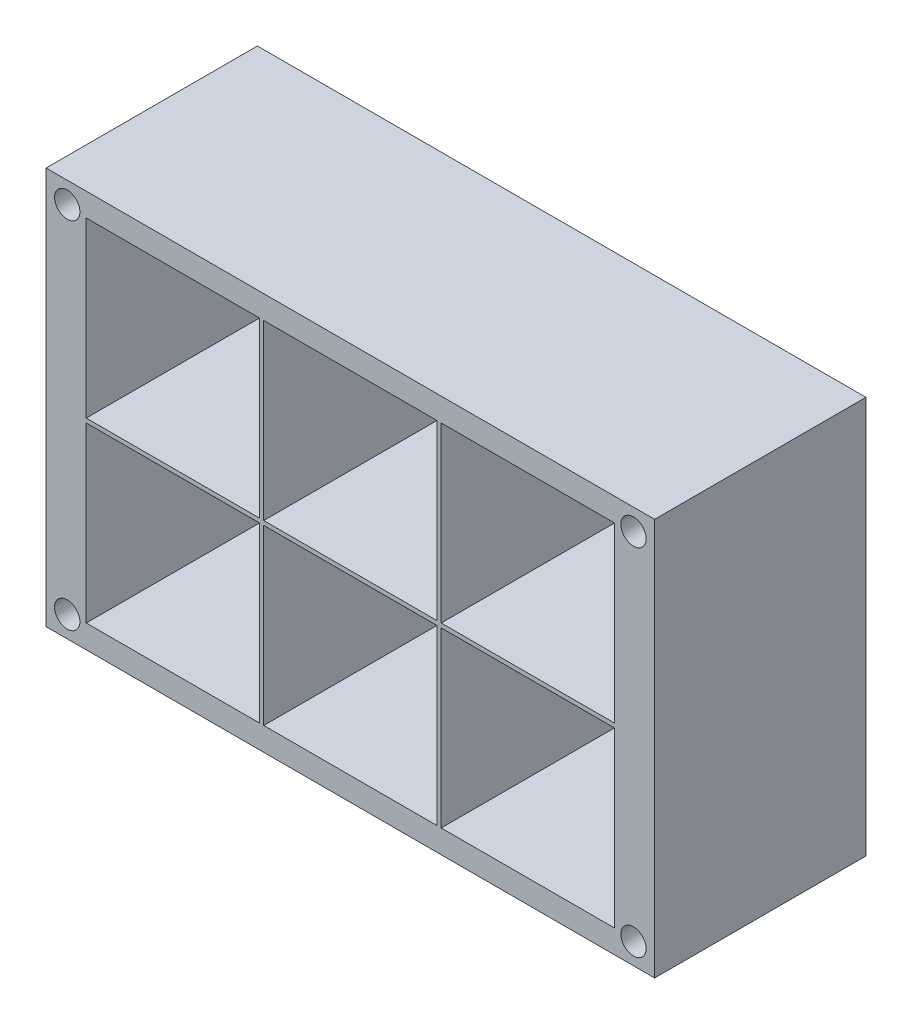
ISO-10303-21;
HEADER;
FILE_DESCRIPTION(('STEP AP214'),'2;1');
FILE_NAME('part.step','',(''),(''),'','','');
FILE_SCHEMA(('AUTOMOTIVE_DESIGN { 1 0 10303 214 1 1 1 1 }'));
ENDSEC;
DATA;
#1=APPLICATION_CONTEXT('core data for automotive mechanical design processes');
#2=APPLICATION_PROTOCOL_DEFINITION('international standard','automotive_design',2000,#1);
#3=PRODUCT_CONTEXT('',#1,'mechanical');
#4=PRODUCT('Part','Part','',(#3));
#5=PRODUCT_RELATED_PRODUCT_CATEGORY('part','',(#4));
#6=PRODUCT_DEFINITION_FORMATION('','',#4);
#7=PRODUCT_DEFINITION_CONTEXT('part definition',#1,'design');
#8=PRODUCT_DEFINITION('design','',#6,#7);
#9=PRODUCT_DEFINITION_SHAPE('','',#8);
#10=(LENGTH_UNIT() NAMED_UNIT(*) SI_UNIT(.MILLI.,.METRE.));
#11=(NAMED_UNIT(*) PLANE_ANGLE_UNIT() SI_UNIT($,.RADIAN.));
#12=(NAMED_UNIT(*) SI_UNIT($,.STERADIAN.) SOLID_ANGLE_UNIT());
#13=UNCERTAINTY_MEASURE_WITH_UNIT(LENGTH_MEASURE(1.E-05),#10,'distance_accuracy_value','');
#14=(GEOMETRIC_REPRESENTATION_CONTEXT(3) GLOBAL_UNCERTAINTY_ASSIGNED_CONTEXT((#13)) GLOBAL_UNIT_ASSIGNED_CONTEXT((#10,
#11,#12)) REPRESENTATION_CONTEXT('',''));
#15=CARTESIAN_POINT('',(0.,0.,0.));
#16=DIRECTION('',(0.,0.,1.));
#17=DIRECTION('',(1.,0.,0.));
#18=AXIS2_PLACEMENT_3D('',#15,#16,#17);
#19=CARTESIAN_POINT('',(0.,0.,25.));
#20=DIRECTION('',(0.,0.,1.));
#21=DIRECTION('',(1.,0.,0.));
#22=AXIS2_PLACEMENT_3D('',#19,#20,#21);
#23=PLANE('',#22);
#24=CARTESIAN_POINT('',(-82.8848384424191,62.1739891406479,25.));
#25=DIRECTION('',(0.,0.,1.));
#26=DIRECTION('',(1.,0.,0.));
#27=AXIS2_PLACEMENT_3D('',#24,#25,#26);
#28=CIRCLE('',#27,1.50000000000001);
#29=CARTESIAN_POINT('',(-81.3848384424191,62.1739891406479,25.));
#30=VERTEX_POINT('',#29);
#31=EDGE_CURVE('E761',#30,#30,#28,.T.);
#32=ORIENTED_EDGE('',*,*,#31,.F.);
#33=EDGE_LOOP('',(#32));
#34=FACE_BOUND('',#33,.T.);
#35=CARTESIAN_POINT('',(-15.8848384424187,20.1739891406484,25.));
#36=DIRECTION('',(0.,0.,1.));
#37=DIRECTION('',(1.,0.,0.));
#38=AXIS2_PLACEMENT_3D('',#35,#36,#37);
#39=CIRCLE('',#38,1.5);
#40=CARTESIAN_POINT('',(-14.3848384424187,20.1739891406484,25.));
#41=VERTEX_POINT('',#40);
#42=EDGE_CURVE('E767',#41,#41,#39,.T.);
#43=ORIENTED_EDGE('',*,*,#42,.F.);
#44=EDGE_LOOP('',(#43));
#45=FACE_BOUND('',#44,.T.);
#46=CARTESIAN_POINT('',(-82.8848384424187,20.1739891406479,25.));
#47=DIRECTION('',(0.,0.,1.));
#48=DIRECTION('',(1.,0.,0.));
#49=AXIS2_PLACEMENT_3D('',#46,#47,#48);
#50=CIRCLE('',#49,1.50000000000001);
#51=CARTESIAN_POINT('',(-81.3848384424187,20.1739891406479,25.));
#52=VERTEX_POINT('',#51);
#53=EDGE_CURVE('E784',#52,#52,#50,.T.);
#54=ORIENTED_EDGE('',*,*,#53,.F.);
#55=EDGE_LOOP('',(#54));
#56=FACE_BOUND('',#55,.T.);
#57=CARTESIAN_POINT('',(-15.8848384424191,62.1739891406484,25.));
#58=DIRECTION('',(0.,0.,1.));
#59=DIRECTION('',(1.,0.,0.));
#60=AXIS2_PLACEMENT_3D('',#57,#58,#59);
#61=CIRCLE('',#60,1.5);
#62=CARTESIAN_POINT('',(-14.3848384424191,62.1739891406484,25.));
#63=VERTEX_POINT('',#62);
#64=EDGE_CURVE('E764',#63,#63,#61,.T.);
#65=ORIENTED_EDGE('',*,*,#64,.F.);
#66=EDGE_LOOP('',(#65));
#67=FACE_BOUND('',#66,.T.);
#68=DIRECTION('',(0.,-1.,0.));
#69=VECTOR('',#68,1.);
#70=CARTESIAN_POINT('',(-85.3848384424192,64.6739891406484,25.));
#71=LINE('',#70,#69);
#72=CARTESIAN_POINT('',(-85.3848384424192,64.6739891406484,25.));
#73=VERTEX_POINT('',#72);
#74=CARTESIAN_POINT('',(-85.3848384424192,17.6739891406484,25.));
#75=VERTEX_POINT('',#74);
#76=EDGE_CURVE('E411',#73,#75,#71,.T.);
#77=ORIENTED_EDGE('',*,*,#76,.T.);
#78=DIRECTION('',(1.,0.,0.));
#79=VECTOR('',#78,1.);
#80=CARTESIAN_POINT('',(-85.3848384424192,17.6739891406484,25.));
#81=LINE('',#80,#79);
#82=CARTESIAN_POINT('',(-13.3848384424191,17.6739891406484,25.));
#83=VERTEX_POINT('',#82);
#84=EDGE_CURVE('E414',#75,#83,#81,.T.);
#85=ORIENTED_EDGE('',*,*,#84,.T.);
#86=DIRECTION('',(0.,1.,0.));
#87=VECTOR('',#86,1.);
#88=CARTESIAN_POINT('',(-13.3848384424191,64.6739891406484,25.));
#89=LINE('',#88,#87);
#90=CARTESIAN_POINT('',(-13.3848384424191,64.6739891406484,25.));
#91=VERTEX_POINT('',#90);
#92=EDGE_CURVE('E417',#83,#91,#89,.T.);
#93=ORIENTED_EDGE('',*,*,#92,.T.);
#94=DIRECTION('',(-1.,0.,0.));
#95=VECTOR('',#94,1.);
#96=CARTESIAN_POINT('',(-85.3848384424192,64.6739891406484,25.));
#97=LINE('',#96,#95);
#98=EDGE_CURVE('E419',#91,#73,#97,.T.);
#99=ORIENTED_EDGE('',*,*,#98,.T.);
#100=EDGE_LOOP('',(#77,#85,#93,#99));
#101=FACE_BOUND('',#100,.T.);
#102=DIRECTION('',(1.,0.,0.));
#103=VECTOR('',#102,1.);
#104=CARTESIAN_POINT('',(-80.6348384424191,20.4239891406484,25.));
#105=LINE('',#104,#103);
#106=CARTESIAN_POINT('',(-80.6348384424191,20.4239891406484,25.));
#107=VERTEX_POINT('',#106);
#108=CARTESIAN_POINT('',(-60.1348384424191,20.4239891406484,25.));
#109=VERTEX_POINT('',#108);
#110=EDGE_CURVE('E382',#107,#109,#105,.T.);
#111=ORIENTED_EDGE('',*,*,#110,.F.);
#112=DIRECTION('',(0.,-1.,0.));
#113=VECTOR('',#112,1.);
#114=CARTESIAN_POINT('',(-80.6348384424191,40.9239891406484,25.));
#115=LINE('',#114,#113);
#116=CARTESIAN_POINT('',(-80.6348384424191,40.9239891406484,25.));
#117=VERTEX_POINT('',#116);
#118=EDGE_CURVE('E380',#117,#107,#115,.T.);
#119=ORIENTED_EDGE('',*,*,#118,.F.);
#120=DIRECTION('',(-1.,0.,0.));
#121=VECTOR('',#120,1.);
#122=CARTESIAN_POINT('',(-80.6348384424191,40.9239891406484,25.));
#123=LINE('',#122,#121);
#124=CARTESIAN_POINT('',(-60.1348384424191,40.9239891406484,25.));
#125=VERTEX_POINT('',#124);
#126=EDGE_CURVE('E388',#125,#117,#123,.T.);
#127=ORIENTED_EDGE('',*,*,#126,.F.);
#128=DIRECTION('',(0.,1.,0.));
#129=VECTOR('',#128,1.);
#130=CARTESIAN_POINT('',(-60.1348384424191,40.9239891406484,25.));
#131=LINE('',#130,#129);
#132=EDGE_CURVE('E385',#109,#125,#131,.T.);
#133=ORIENTED_EDGE('',*,*,#132,.F.);
#134=EDGE_LOOP('',(#111,#119,#127,#133));
#135=FACE_BOUND('',#134,.T.);
#136=DIRECTION('',(0.,-1.,0.));
#137=VECTOR('',#136,1.);
#138=CARTESIAN_POINT('',(-80.6348384424192,61.9239891406484,25.));
#139=LINE('',#138,#137);
#140=CARTESIAN_POINT('',(-80.6348384424192,61.9239891406484,25.));
#141=VERTEX_POINT('',#140);
#142=CARTESIAN_POINT('',(-80.6348384424192,41.4239891406484,25.));
#143=VERTEX_POINT('',#142);
#144=EDGE_CURVE('E351',#141,#143,#139,.T.);
#145=ORIENTED_EDGE('',*,*,#144,.F.);
#146=DIRECTION('',(-1.,0.,0.));
#147=VECTOR('',#146,1.);
#148=CARTESIAN_POINT('',(-80.6348384424192,61.9239891406484,25.));
#149=LINE('',#148,#147);
#150=CARTESIAN_POINT('',(-60.1348384424192,61.9239891406484,25.));
#151=VERTEX_POINT('',#150);
#152=EDGE_CURVE('E349',#151,#141,#149,.T.);
#153=ORIENTED_EDGE('',*,*,#152,.F.);
#154=DIRECTION('',(0.,1.,0.));
#155=VECTOR('',#154,1.);
#156=CARTESIAN_POINT('',(-60.1348384424192,61.9239891406484,25.));
#157=LINE('',#156,#155);
#158=CARTESIAN_POINT('',(-60.1348384424192,41.4239891406484,25.));
#159=VERTEX_POINT('',#158);
#160=EDGE_CURVE('E357',#159,#151,#157,.T.);
#161=ORIENTED_EDGE('',*,*,#160,.F.);
#162=DIRECTION('',(1.,0.,0.));
#163=VECTOR('',#162,1.);
#164=CARTESIAN_POINT('',(-80.6348384424192,41.4239891406484,25.));
#165=LINE('',#164,#163);
#166=EDGE_CURVE('E354',#143,#159,#165,.T.);
#167=ORIENTED_EDGE('',*,*,#166,.F.);
#168=EDGE_LOOP('',(#145,#153,#161,#167));
#169=FACE_BOUND('',#168,.T.);
#170=DIRECTION('',(0.,-1.,0.));
#171=VECTOR('',#170,1.);
#172=CARTESIAN_POINT('',(-59.6348384424191,40.9239891406484,25.));
#173=LINE('',#172,#171);
#174=CARTESIAN_POINT('',(-59.6348384424191,40.9239891406484,25.));
#175=VERTEX_POINT('',#174);
#176=CARTESIAN_POINT('',(-59.6348384424191,20.4239891406484,25.));
#177=VERTEX_POINT('',#176);
#178=EDGE_CURVE('E320',#175,#177,#173,.T.);
#179=ORIENTED_EDGE('',*,*,#178,.F.);
#180=DIRECTION('',(-1.,0.,0.));
#181=VECTOR('',#180,1.);
#182=CARTESIAN_POINT('',(-59.6348384424191,40.9239891406484,25.));
#183=LINE('',#182,#181);
#184=CARTESIAN_POINT('',(-39.1348384424191,40.9239891406484,25.));
#185=VERTEX_POINT('',#184);
#186=EDGE_CURVE('E318',#185,#175,#183,.T.);
#187=ORIENTED_EDGE('',*,*,#186,.F.);
#188=DIRECTION('',(0.,1.,0.));
#189=VECTOR('',#188,1.);
#190=CARTESIAN_POINT('',(-39.1348384424191,40.9239891406484,25.));
#191=LINE('',#190,#189);
#192=CARTESIAN_POINT('',(-39.1348384424191,20.4239891406484,25.));
#193=VERTEX_POINT('',#192);
#194=EDGE_CURVE('E326',#193,#185,#191,.T.);
#195=ORIENTED_EDGE('',*,*,#194,.F.);
#196=DIRECTION('',(1.,0.,0.));
#197=VECTOR('',#196,1.);
#198=CARTESIAN_POINT('',(-59.6348384424191,20.4239891406484,25.));
#199=LINE('',#198,#197);
#200=EDGE_CURVE('E323',#177,#193,#199,.T.);
#201=ORIENTED_EDGE('',*,*,#200,.F.);
#202=EDGE_LOOP('',(#179,#187,#195,#201));
#203=FACE_BOUND('',#202,.T.);
#204=DIRECTION('',(0.,-1.,0.));
#205=VECTOR('',#204,1.);
#206=CARTESIAN_POINT('',(-38.6348384424191,40.9239891406484,25.));
#207=LINE('',#206,#205);
#208=CARTESIAN_POINT('',(-38.6348384424191,40.9239891406484,25.));
#209=VERTEX_POINT('',#208);
#210=CARTESIAN_POINT('',(-38.6348384424191,20.4239891406484,25.));
#211=VERTEX_POINT('',#210);
#212=EDGE_CURVE('E289',#209,#211,#207,.T.);
#213=ORIENTED_EDGE('',*,*,#212,.F.);
#214=DIRECTION('',(-1.,0.,0.));
#215=VECTOR('',#214,1.);
#216=CARTESIAN_POINT('',(-38.6348384424191,40.9239891406484,25.));
#217=LINE('',#216,#215);
#218=CARTESIAN_POINT('',(-18.1348384424191,40.9239891406484,25.));
#219=VERTEX_POINT('',#218);
#220=EDGE_CURVE('E287',#219,#209,#217,.T.);
#221=ORIENTED_EDGE('',*,*,#220,.F.);
#222=DIRECTION('',(0.,1.,0.));
#223=VECTOR('',#222,1.);
#224=CARTESIAN_POINT('',(-18.1348384424191,40.9239891406484,25.));
#225=LINE('',#224,#223);
#226=CARTESIAN_POINT('',(-18.1348384424191,20.4239891406484,25.));
#227=VERTEX_POINT('',#226);
#228=EDGE_CURVE('E295',#227,#219,#225,.T.);
#229=ORIENTED_EDGE('',*,*,#228,.F.);
#230=DIRECTION('',(1.,0.,0.));
#231=VECTOR('',#230,1.);
#232=CARTESIAN_POINT('',(-38.6348384424191,20.4239891406484,25.));
#233=LINE('',#232,#231);
#234=EDGE_CURVE('E292',#211,#227,#233,.T.);
#235=ORIENTED_EDGE('',*,*,#234,.F.);
#236=EDGE_LOOP('',(#213,#221,#229,#235));
#237=FACE_BOUND('',#236,.T.);
#238=DIRECTION('',(0.,-1.,0.));
#239=VECTOR('',#238,1.);
#240=CARTESIAN_POINT('',(-59.6348384424192,61.9239891406484,25.));
#241=LINE('',#240,#239);
#242=CARTESIAN_POINT('',(-59.6348384424192,61.9239891406484,25.));
#243=VERTEX_POINT('',#242);
#244=CARTESIAN_POINT('',(-59.6348384424192,41.4239891406484,25.));
#245=VERTEX_POINT('',#244);
#246=EDGE_CURVE('E258',#243,#245,#241,.T.);
#247=ORIENTED_EDGE('',*,*,#246,.F.);
#248=DIRECTION('',(-1.,0.,0.));
#249=VECTOR('',#248,1.);
#250=CARTESIAN_POINT('',(-59.6348384424192,61.9239891406484,25.));
#251=LINE('',#250,#249);
#252=CARTESIAN_POINT('',(-39.1348384424192,61.9239891406484,25.));
#253=VERTEX_POINT('',#252);
#254=EDGE_CURVE('E256',#253,#243,#251,.T.);
#255=ORIENTED_EDGE('',*,*,#254,.F.);
#256=DIRECTION('',(0.,1.,0.));
#257=VECTOR('',#256,1.);
#258=CARTESIAN_POINT('',(-39.1348384424192,61.9239891406484,25.));
#259=LINE('',#258,#257);
#260=CARTESIAN_POINT('',(-39.1348384424192,41.4239891406484,25.));
#261=VERTEX_POINT('',#260);
#262=EDGE_CURVE('E264',#261,#253,#259,.T.);
#263=ORIENTED_EDGE('',*,*,#262,.F.);
#264=DIRECTION('',(1.,0.,0.));
#265=VECTOR('',#264,1.);
#266=CARTESIAN_POINT('',(-59.6348384424192,41.4239891406484,25.));
#267=LINE('',#266,#265);
#268=EDGE_CURVE('E261',#245,#261,#267,.T.);
#269=ORIENTED_EDGE('',*,*,#268,.F.);
#270=EDGE_LOOP('',(#247,#255,#263,#269));
#271=FACE_BOUND('',#270,.T.);
#272=DIRECTION('',(0.,-1.,0.));
#273=VECTOR('',#272,1.);
#274=CARTESIAN_POINT('',(-38.6348384424192,61.9239891406484,25.));
#275=LINE('',#274,#273);
#276=CARTESIAN_POINT('',(-38.6348384424192,61.9239891406484,25.));
#277=VERTEX_POINT('',#276);
#278=CARTESIAN_POINT('',(-38.6348384424192,41.4239891406484,25.));
#279=VERTEX_POINT('',#278);
#280=EDGE_CURVE('E226',#277,#279,#275,.T.);
#281=ORIENTED_EDGE('',*,*,#280,.F.);
#282=DIRECTION('',(-1.,0.,0.));
#283=VECTOR('',#282,1.);
#284=CARTESIAN_POINT('',(-38.6348384424192,61.9239891406484,25.));
#285=LINE('',#284,#283);
#286=CARTESIAN_POINT('',(-18.1348384424192,61.9239891406484,25.));
#287=VERTEX_POINT('',#286);
#288=EDGE_CURVE('E218',#287,#277,#285,.T.);
#289=ORIENTED_EDGE('',*,*,#288,.F.);
#290=DIRECTION('',(0.,1.,0.));
#291=VECTOR('',#290,1.);
#292=CARTESIAN_POINT('',(-18.1348384424192,61.9239891406484,25.));
#293=LINE('',#292,#291);
#294=CARTESIAN_POINT('',(-18.1348384424192,41.4239891406484,25.));
#295=VERTEX_POINT('',#294);
#296=EDGE_CURVE('E240',#295,#287,#293,.T.);
#297=ORIENTED_EDGE('',*,*,#296,.F.);
#298=DIRECTION('',(1.,0.,0.));
#299=VECTOR('',#298,1.);
#300=CARTESIAN_POINT('',(-38.6348384424192,41.4239891406484,25.));
#301=LINE('',#300,#299);
#302=EDGE_CURVE('E238',#279,#295,#301,.T.);
#303=ORIENTED_EDGE('',*,*,#302,.F.);
#304=EDGE_LOOP('',(#281,#289,#297,#303));
#305=FACE_BOUND('',#304,.T.);
#306=ADVANCED_FACE('F33',(#34,#45,#56,#67,#101,#135,#169,#203,#237,#271,#305),#23,.T.);
#307=CARTESIAN_POINT('',(0.,0.,0.));
#308=DIRECTION('',(0.,0.,1.));
#309=DIRECTION('',(1.,0.,0.));
#310=AXIS2_PLACEMENT_3D('',#307,#308,#309);
#311=PLANE('',#310);
#312=CARTESIAN_POINT('',(-82.8848384424191,62.1739891406479,0.));
#313=DIRECTION('',(0.,0.,1.));
#314=DIRECTION('',(1.,0.,0.));
#315=AXIS2_PLACEMENT_3D('',#312,#313,#314);
#316=CIRCLE('',#315,1.50000000000001);
#317=CARTESIAN_POINT('',(-81.3848384424191,62.1739891406479,0.));
#318=VERTEX_POINT('',#317);
#319=EDGE_CURVE('E759',#318,#318,#316,.T.);
#320=ORIENTED_EDGE('',*,*,#319,.T.);
#321=EDGE_LOOP('',(#320));
#322=FACE_BOUND('',#321,.T.);
#323=CARTESIAN_POINT('',(-15.8848384424187,20.1739891406484,0.));
#324=DIRECTION('',(0.,0.,1.));
#325=DIRECTION('',(1.,0.,0.));
#326=AXIS2_PLACEMENT_3D('',#323,#324,#325);
#327=CIRCLE('',#326,1.5);
#328=CARTESIAN_POINT('',(-14.3848384424187,20.1739891406484,0.));
#329=VERTEX_POINT('',#328);
#330=EDGE_CURVE('E762',#329,#329,#327,.T.);
#331=ORIENTED_EDGE('',*,*,#330,.T.);
#332=EDGE_LOOP('',(#331));
#333=FACE_BOUND('',#332,.T.);
#334=CARTESIAN_POINT('',(-82.8848384424187,20.1739891406479,0.));
#335=DIRECTION('',(0.,0.,1.));
#336=DIRECTION('',(1.,0.,0.));
#337=AXIS2_PLACEMENT_3D('',#334,#335,#336);
#338=CIRCLE('',#337,1.50000000000001);
#339=CARTESIAN_POINT('',(-81.3848384424187,20.1739891406479,0.));
#340=VERTEX_POINT('',#339);
#341=EDGE_CURVE('E773',#340,#340,#338,.T.);
#342=ORIENTED_EDGE('',*,*,#341,.T.);
#343=EDGE_LOOP('',(#342));
#344=FACE_BOUND('',#343,.T.);
#345=CARTESIAN_POINT('',(-15.8848384424191,62.1739891406484,0.));
#346=DIRECTION('',(0.,0.,1.));
#347=DIRECTION('',(1.,0.,0.));
#348=AXIS2_PLACEMENT_3D('',#345,#346,#347);
#349=CIRCLE('',#348,1.5);
#350=CARTESIAN_POINT('',(-14.3848384424191,62.1739891406484,0.));
#351=VERTEX_POINT('',#350);
#352=EDGE_CURVE('E246',#351,#351,#349,.T.);
#353=ORIENTED_EDGE('',*,*,#352,.T.);
#354=EDGE_LOOP('',(#353));
#355=FACE_BOUND('',#354,.T.);
#356=DIRECTION('',(-1.,0.,0.));
#357=VECTOR('',#356,1.);
#358=CARTESIAN_POINT('',(-59.6348384424192,61.9239891406484,0.));
#359=LINE('',#358,#357);
#360=CARTESIAN_POINT('',(-39.1348384424192,61.9239891406484,0.));
#361=VERTEX_POINT('',#360);
#362=CARTESIAN_POINT('',(-59.6348384424192,61.9239891406484,0.));
#363=VERTEX_POINT('',#362);
#364=EDGE_CURVE('E234',#361,#363,#359,.T.);
#365=ORIENTED_EDGE('',*,*,#364,.T.);
#366=DIRECTION('',(0.,-1.,0.));
#367=VECTOR('',#366,1.);
#368=CARTESIAN_POINT('',(-59.6348384424192,61.9239891406484,0.));
#369=LINE('',#368,#367);
#370=CARTESIAN_POINT('',(-59.6348384424192,41.4239891406484,0.));
#371=VERTEX_POINT('',#370);
#372=EDGE_CURVE('E269',#363,#371,#369,.T.);
#373=ORIENTED_EDGE('',*,*,#372,.T.);
#374=DIRECTION('',(1.,0.,0.));
#375=VECTOR('',#374,1.);
#376=CARTESIAN_POINT('',(-59.6348384424192,41.4239891406484,0.));
#377=LINE('',#376,#375);
#378=CARTESIAN_POINT('',(-39.1348384424192,41.4239891406484,0.));
#379=VERTEX_POINT('',#378);
#380=EDGE_CURVE('E272',#371,#379,#377,.T.);
#381=ORIENTED_EDGE('',*,*,#380,.T.);
#382=DIRECTION('',(0.,1.,0.));
#383=VECTOR('',#382,1.);
#384=CARTESIAN_POINT('',(-39.1348384424192,61.9239891406484,0.));
#385=LINE('',#384,#383);
#386=EDGE_CURVE('E259',#379,#361,#385,.T.);
#387=ORIENTED_EDGE('',*,*,#386,.T.);
#388=EDGE_LOOP('',(#365,#373,#381,#387));
#389=FACE_BOUND('',#388,.T.);
#390=DIRECTION('',(-1.,0.,0.));
#391=VECTOR('',#390,1.);
#392=CARTESIAN_POINT('',(-59.6348384424191,40.9239891406484,0.));
#393=LINE('',#392,#391);
#394=CARTESIAN_POINT('',(-39.1348384424191,40.9239891406484,0.));
#395=VERTEX_POINT('',#394);
#396=CARTESIAN_POINT('',(-59.6348384424191,40.9239891406484,0.));
#397=VERTEX_POINT('',#396);
#398=EDGE_CURVE('E317',#395,#397,#393,.T.);
#399=ORIENTED_EDGE('',*,*,#398,.T.);
#400=DIRECTION('',(0.,-1.,0.));
#401=VECTOR('',#400,1.);
#402=CARTESIAN_POINT('',(-59.6348384424191,40.9239891406484,0.));
#403=LINE('',#402,#401);
#404=CARTESIAN_POINT('',(-59.6348384424191,20.4239891406484,0.));
#405=VERTEX_POINT('',#404);
#406=EDGE_CURVE('E331',#397,#405,#403,.T.);
#407=ORIENTED_EDGE('',*,*,#406,.T.);
#408=DIRECTION('',(1.,0.,0.));
#409=VECTOR('',#408,1.);
#410=CARTESIAN_POINT('',(-59.6348384424191,20.4239891406484,0.));
#411=LINE('',#410,#409);
#412=CARTESIAN_POINT('',(-39.1348384424191,20.4239891406484,0.));
#413=VERTEX_POINT('',#412);
#414=EDGE_CURVE('E334',#405,#413,#411,.T.);
#415=ORIENTED_EDGE('',*,*,#414,.T.);
#416=DIRECTION('',(0.,1.,0.));
#417=VECTOR('',#416,1.);
#418=CARTESIAN_POINT('',(-39.1348384424191,40.9239891406484,0.));
#419=LINE('',#418,#417);
#420=EDGE_CURVE('E321',#413,#395,#419,.T.);
#421=ORIENTED_EDGE('',*,*,#420,.T.);
#422=EDGE_LOOP('',(#399,#407,#415,#421));
#423=FACE_BOUND('',#422,.T.);
#424=DIRECTION('',(0.,-1.,0.));
#425=VECTOR('',#424,1.);
#426=CARTESIAN_POINT('',(-80.6348384424191,40.9239891406484,0.));
#427=LINE('',#426,#425);
#428=CARTESIAN_POINT('',(-80.6348384424191,40.9239891406484,0.));
#429=VERTEX_POINT('',#428);
#430=CARTESIAN_POINT('',(-80.6348384424191,20.4239891406484,0.));
#431=VERTEX_POINT('',#430);
#432=EDGE_CURVE('E379',#429,#431,#427,.T.);
#433=ORIENTED_EDGE('',*,*,#432,.T.);
#434=DIRECTION('',(1.,0.,0.));
#435=VECTOR('',#434,1.);
#436=CARTESIAN_POINT('',(-80.6348384424191,20.4239891406484,0.));
#437=LINE('',#436,#435);
#438=CARTESIAN_POINT('',(-60.1348384424191,20.4239891406484,0.));
#439=VERTEX_POINT('',#438);
#440=EDGE_CURVE('E393',#431,#439,#437,.T.);
#441=ORIENTED_EDGE('',*,*,#440,.T.);
#442=DIRECTION('',(0.,1.,0.));
#443=VECTOR('',#442,1.);
#444=CARTESIAN_POINT('',(-60.1348384424191,40.9239891406484,0.));
#445=LINE('',#444,#443);
#446=CARTESIAN_POINT('',(-60.1348384424191,40.9239891406484,0.));
#447=VERTEX_POINT('',#446);
#448=EDGE_CURVE('E396',#439,#447,#445,.T.);
#449=ORIENTED_EDGE('',*,*,#448,.T.);
#450=DIRECTION('',(-1.,0.,0.));
#451=VECTOR('',#450,1.);
#452=CARTESIAN_POINT('',(-80.6348384424191,40.9239891406484,0.));
#453=LINE('',#452,#451);
#454=EDGE_CURVE('E383',#447,#429,#453,.T.);
#455=ORIENTED_EDGE('',*,*,#454,.T.);
#456=EDGE_LOOP('',(#433,#441,#449,#455));
#457=FACE_BOUND('',#456,.T.);
#458=DIRECTION('',(0.,-1.,0.));
#459=VECTOR('',#458,1.);
#460=CARTESIAN_POINT('',(-85.3848384424192,64.6739891406484,0.));
#461=LINE('',#460,#459);
#462=CARTESIAN_POINT('',(-85.3848384424192,64.6739891406484,0.));
#463=VERTEX_POINT('',#462);
#464=CARTESIAN_POINT('',(-85.3848384424192,17.6739891406484,0.));
#465=VERTEX_POINT('',#464);
#466=EDGE_CURVE('E410',#463,#465,#461,.T.);
#467=ORIENTED_EDGE('',*,*,#466,.F.);
#468=DIRECTION('',(-1.,0.,0.));
#469=VECTOR('',#468,1.);
#470=CARTESIAN_POINT('',(-85.3848384424192,64.6739891406484,0.));
#471=LINE('',#470,#469);
#472=CARTESIAN_POINT('',(-13.3848384424191,64.6739891406484,0.));
#473=VERTEX_POINT('',#472);
#474=EDGE_CURVE('E415',#473,#463,#471,.T.);
#475=ORIENTED_EDGE('',*,*,#474,.F.);
#476=DIRECTION('',(0.,1.,0.));
#477=VECTOR('',#476,1.);
#478=CARTESIAN_POINT('',(-13.3848384424191,64.6739891406484,0.));
#479=LINE('',#478,#477);
#480=CARTESIAN_POINT('',(-13.3848384424191,17.6739891406484,0.));
#481=VERTEX_POINT('',#480);
#482=EDGE_CURVE('E426',#481,#473,#479,.T.);
#483=ORIENTED_EDGE('',*,*,#482,.F.);
#484=DIRECTION('',(1.,0.,0.));
#485=VECTOR('',#484,1.);
#486=CARTESIAN_POINT('',(-85.3848384424192,17.6739891406484,0.));
#487=LINE('',#486,#485);
#488=EDGE_CURVE('E424',#465,#481,#487,.T.);
#489=ORIENTED_EDGE('',*,*,#488,.F.);
#490=EDGE_LOOP('',(#467,#475,#483,#489));
#491=FACE_BOUND('',#490,.T.);
#492=DIRECTION('',(-1.,0.,0.));
#493=VECTOR('',#492,1.);
#494=CARTESIAN_POINT('',(-80.6348384424192,61.9239891406484,0.));
#495=LINE('',#494,#493);
#496=CARTESIAN_POINT('',(-60.1348384424192,61.9239891406484,0.));
#497=VERTEX_POINT('',#496);
#498=CARTESIAN_POINT('',(-80.6348384424192,61.9239891406484,0.));
#499=VERTEX_POINT('',#498);
#500=EDGE_CURVE('E348',#497,#499,#495,.T.);
#501=ORIENTED_EDGE('',*,*,#500,.T.);
#502=DIRECTION('',(0.,-1.,0.));
#503=VECTOR('',#502,1.);
#504=CARTESIAN_POINT('',(-80.6348384424192,61.9239891406484,0.));
#505=LINE('',#504,#503);
#506=CARTESIAN_POINT('',(-80.6348384424192,41.4239891406484,0.));
#507=VERTEX_POINT('',#506);
#508=EDGE_CURVE('E362',#499,#507,#505,.T.);
#509=ORIENTED_EDGE('',*,*,#508,.T.);
#510=DIRECTION('',(1.,0.,0.));
#511=VECTOR('',#510,1.);
#512=CARTESIAN_POINT('',(-80.6348384424192,41.4239891406484,0.));
#513=LINE('',#512,#511);
#514=CARTESIAN_POINT('',(-60.1348384424192,41.4239891406484,0.));
#515=VERTEX_POINT('',#514);
#516=EDGE_CURVE('E365',#507,#515,#513,.T.);
#517=ORIENTED_EDGE('',*,*,#516,.T.);
#518=DIRECTION('',(0.,1.,0.));
#519=VECTOR('',#518,1.);
#520=CARTESIAN_POINT('',(-60.1348384424192,61.9239891406484,0.));
#521=LINE('',#520,#519);
#522=EDGE_CURVE('E352',#515,#497,#521,.T.);
#523=ORIENTED_EDGE('',*,*,#522,.T.);
#524=EDGE_LOOP('',(#501,#509,#517,#523));
#525=FACE_BOUND('',#524,.T.);
#526=DIRECTION('',(-1.,0.,0.));
#527=VECTOR('',#526,1.);
#528=CARTESIAN_POINT('',(-38.6348384424191,40.9239891406484,0.));
#529=LINE('',#528,#527);
#530=CARTESIAN_POINT('',(-18.1348384424191,40.9239891406484,0.));
#531=VERTEX_POINT('',#530);
#532=CARTESIAN_POINT('',(-38.6348384424191,40.9239891406484,0.));
#533=VERTEX_POINT('',#532);
#534=EDGE_CURVE('E286',#531,#533,#529,.T.);
#535=ORIENTED_EDGE('',*,*,#534,.T.);
#536=DIRECTION('',(0.,-1.,0.));
#537=VECTOR('',#536,1.);
#538=CARTESIAN_POINT('',(-38.6348384424191,40.9239891406484,0.));
#539=LINE('',#538,#537);
#540=CARTESIAN_POINT('',(-38.6348384424191,20.4239891406484,0.));
#541=VERTEX_POINT('',#540);
#542=EDGE_CURVE('E300',#533,#541,#539,.T.);
#543=ORIENTED_EDGE('',*,*,#542,.T.);
#544=DIRECTION('',(1.,0.,0.));
#545=VECTOR('',#544,1.);
#546=CARTESIAN_POINT('',(-38.6348384424191,20.4239891406484,0.));
#547=LINE('',#546,#545);
#548=CARTESIAN_POINT('',(-18.1348384424191,20.4239891406484,0.));
#549=VERTEX_POINT('',#548);
#550=EDGE_CURVE('E303',#541,#549,#547,.T.);
#551=ORIENTED_EDGE('',*,*,#550,.T.);
#552=DIRECTION('',(0.,1.,0.));
#553=VECTOR('',#552,1.);
#554=CARTESIAN_POINT('',(-18.1348384424191,40.9239891406484,0.));
#555=LINE('',#554,#553);
#556=EDGE_CURVE('E290',#549,#531,#555,.T.);
#557=ORIENTED_EDGE('',*,*,#556,.T.);
#558=EDGE_LOOP('',(#535,#543,#551,#557));
#559=FACE_BOUND('',#558,.T.);
#560=DIRECTION('',(-1.,0.,0.));
#561=VECTOR('',#560,1.);
#562=CARTESIAN_POINT('',(-38.6348384424192,61.9239891406484,0.));
#563=LINE('',#562,#561);
#564=CARTESIAN_POINT('',(-18.1348384424192,61.9239891406484,0.));
#565=VERTEX_POINT('',#564);
#566=CARTESIAN_POINT('',(-38.6348384424192,61.9239891406484,0.));
#567=VERTEX_POINT('',#566);
#568=EDGE_CURVE('E56',#565,#567,#563,.T.);
#569=ORIENTED_EDGE('',*,*,#568,.T.);
#570=DIRECTION('',(0.,-1.,0.));
#571=VECTOR('',#570,1.);
#572=CARTESIAN_POINT('',(-38.6348384424192,61.9239891406484,0.));
#573=LINE('',#572,#571);
#574=CARTESIAN_POINT('',(-38.6348384424192,41.4239891406484,0.));
#575=VERTEX_POINT('',#574);
#576=EDGE_CURVE('E233',#567,#575,#573,.T.);
#577=ORIENTED_EDGE('',*,*,#576,.T.);
#578=DIRECTION('',(1.,0.,0.));
#579=VECTOR('',#578,1.);
#580=CARTESIAN_POINT('',(-38.6348384424192,41.4239891406484,0.));
#581=LINE('',#580,#579);
#582=CARTESIAN_POINT('',(-18.1348384424192,41.4239891406484,0.));
#583=VERTEX_POINT('',#582);
#584=EDGE_CURVE('E248',#575,#583,#581,.T.);
#585=ORIENTED_EDGE('',*,*,#584,.T.);
#586=DIRECTION('',(0.,1.,0.));
#587=VECTOR('',#586,1.);
#588=CARTESIAN_POINT('',(-18.1348384424192,61.9239891406484,0.));
#589=LINE('',#588,#587);
#590=EDGE_CURVE('E227',#583,#565,#589,.T.);
#591=ORIENTED_EDGE('',*,*,#590,.T.);
#592=EDGE_LOOP('',(#569,#577,#585,#591));
#593=FACE_BOUND('',#592,.T.);
#594=ADVANCED_FACE('F444',(#322,#333,#344,#355,#389,#423,#457,#491,#525,#559,#593),#311,.F.);
#595=CARTESIAN_POINT('',(-85.3848384424192,64.6739891406484,25.));
#596=DIRECTION('',(1.,0.,0.));
#597=DIRECTION('',(0.,0.,-1.));
#598=AXIS2_PLACEMENT_3D('',#595,#596,#597);
#599=PLANE('',#598);
#600=ORIENTED_EDGE('',*,*,#466,.T.);
#601=DIRECTION('',(0.,0.,-1.));
#602=VECTOR('',#601,1.);
#603=CARTESIAN_POINT('',(-85.3848384424192,17.6739891406484,25.));
#604=LINE('',#603,#602);
#605=EDGE_CURVE('E11',#75,#465,#604,.T.);
#606=ORIENTED_EDGE('',*,*,#605,.F.);
#607=ORIENTED_EDGE('',*,*,#76,.F.);
#608=DIRECTION('',(0.,0.,-1.));
#609=VECTOR('',#608,1.);
#610=CARTESIAN_POINT('',(-85.3848384424192,64.6739891406484,25.));
#611=LINE('',#610,#609);
#612=EDGE_CURVE('E421',#73,#463,#611,.T.);
#613=ORIENTED_EDGE('',*,*,#612,.T.);
#614=EDGE_LOOP('',(#600,#606,#607,#613));
#615=FACE_BOUND('',#614,.T.);
#616=ADVANCED_FACE('F35',(#615),#599,.F.);
#617=CARTESIAN_POINT('',(-85.3848384424192,17.6739891406484,25.));
#618=DIRECTION('',(0.,1.,0.));
#619=DIRECTION('',(0.,0.,1.));
#620=AXIS2_PLACEMENT_3D('',#617,#618,#619);
#621=PLANE('',#620);
#622=ORIENTED_EDGE('',*,*,#488,.T.);
#623=DIRECTION('',(0.,0.,-1.));
#624=VECTOR('',#623,1.);
#625=CARTESIAN_POINT('',(-13.3848384424191,17.6739891406484,25.));
#626=LINE('',#625,#624);
#627=EDGE_CURVE('E41',#83,#481,#626,.T.);
#628=ORIENTED_EDGE('',*,*,#627,.F.);
#629=ORIENTED_EDGE('',*,*,#84,.F.);
#630=ORIENTED_EDGE('',*,*,#605,.T.);
#631=EDGE_LOOP('',(#622,#628,#629,#630));
#632=FACE_BOUND('',#631,.T.);
#633=ADVANCED_FACE('F455',(#632),#621,.F.);
#634=CARTESIAN_POINT('',(-13.3848384424191,64.6739891406484,25.));
#635=DIRECTION('',(-1.,0.,0.));
#636=DIRECTION('',(0.,0.,1.));
#637=AXIS2_PLACEMENT_3D('',#634,#635,#636);
#638=PLANE('',#637);
#639=ORIENTED_EDGE('',*,*,#482,.T.);
#640=DIRECTION('',(0.,0.,-1.));
#641=VECTOR('',#640,1.);
#642=CARTESIAN_POINT('',(-13.3848384424191,64.6739891406484,25.));
#643=LINE('',#642,#641);
#644=EDGE_CURVE('E431',#91,#473,#643,.T.);
#645=ORIENTED_EDGE('',*,*,#644,.F.);
#646=ORIENTED_EDGE('',*,*,#92,.F.);
#647=ORIENTED_EDGE('',*,*,#627,.T.);
#648=EDGE_LOOP('',(#639,#645,#646,#647));
#649=FACE_BOUND('',#648,.T.);
#650=ADVANCED_FACE('F438',(#649),#638,.F.);
#651=CARTESIAN_POINT('',(-85.3848384424192,64.6739891406484,25.));
#652=DIRECTION('',(0.,-1.,0.));
#653=DIRECTION('',(0.,0.,-1.));
#654=AXIS2_PLACEMENT_3D('',#651,#652,#653);
#655=PLANE('',#654);
#656=ORIENTED_EDGE('',*,*,#474,.T.);
#657=ORIENTED_EDGE('',*,*,#612,.F.);
#658=ORIENTED_EDGE('',*,*,#98,.F.);
#659=ORIENTED_EDGE('',*,*,#644,.T.);
#660=EDGE_LOOP('',(#656,#657,#658,#659));
#661=FACE_BOUND('',#660,.T.);
#662=ADVANCED_FACE('F448',(#661),#655,.F.);
#663=CARTESIAN_POINT('',(-80.6348384424191,40.9239891406484,25.));
#664=DIRECTION('',(1.,0.,0.));
#665=DIRECTION('',(0.,0.,-1.));
#666=AXIS2_PLACEMENT_3D('',#663,#664,#665);
#667=PLANE('',#666);
#668=ORIENTED_EDGE('',*,*,#432,.F.);
#669=DIRECTION('',(0.,0.,-1.));
#670=VECTOR('',#669,1.);
#671=CARTESIAN_POINT('',(-80.6348384424191,40.9239891406484,25.));
#672=LINE('',#671,#670);
#673=EDGE_CURVE('E390',#117,#429,#672,.T.);
#674=ORIENTED_EDGE('',*,*,#673,.F.);
#675=ORIENTED_EDGE('',*,*,#118,.T.);
#676=DIRECTION('',(0.,0.,-1.));
#677=VECTOR('',#676,1.);
#678=CARTESIAN_POINT('',(-80.6348384424191,20.4239891406484,25.));
#679=LINE('',#678,#677);
#680=EDGE_CURVE('E407',#107,#431,#679,.T.);
#681=ORIENTED_EDGE('',*,*,#680,.T.);
#682=EDGE_LOOP('',(#668,#674,#675,#681));
#683=FACE_BOUND('',#682,.T.);
#684=ADVANCED_FACE('F473',(#683),#667,.T.);
#685=CARTESIAN_POINT('',(-80.6348384424191,20.4239891406484,25.));
#686=DIRECTION('',(0.,1.,0.));
#687=DIRECTION('',(0.,0.,1.));
#688=AXIS2_PLACEMENT_3D('',#685,#686,#687);
#689=PLANE('',#688);
#690=ORIENTED_EDGE('',*,*,#440,.F.);
#691=ORIENTED_EDGE('',*,*,#680,.F.);
#692=ORIENTED_EDGE('',*,*,#110,.T.);
#693=DIRECTION('',(0.,0.,-1.));
#694=VECTOR('',#693,1.);
#695=CARTESIAN_POINT('',(-60.1348384424191,20.4239891406484,25.));
#696=LINE('',#695,#694);
#697=EDGE_CURVE('E405',#109,#439,#696,.T.);
#698=ORIENTED_EDGE('',*,*,#697,.T.);
#699=EDGE_LOOP('',(#690,#691,#692,#698));
#700=FACE_BOUND('',#699,.T.);
#701=ADVANCED_FACE('F480',(#700),#689,.T.);
#702=CARTESIAN_POINT('',(-60.1348384424191,40.9239891406484,25.));
#703=DIRECTION('',(-1.,0.,0.));
#704=DIRECTION('',(0.,0.,1.));
#705=AXIS2_PLACEMENT_3D('',#702,#703,#704);
#706=PLANE('',#705);
#707=ORIENTED_EDGE('',*,*,#448,.F.);
#708=ORIENTED_EDGE('',*,*,#697,.F.);
#709=ORIENTED_EDGE('',*,*,#132,.T.);
#710=DIRECTION('',(0.,0.,-1.));
#711=VECTOR('',#710,1.);
#712=CARTESIAN_POINT('',(-60.1348384424191,40.9239891406484,25.));
#713=LINE('',#712,#711);
#714=EDGE_CURVE('E403',#125,#447,#713,.T.);
#715=ORIENTED_EDGE('',*,*,#714,.T.);
#716=EDGE_LOOP('',(#707,#708,#709,#715));
#717=FACE_BOUND('',#716,.T.);
#718=ADVANCED_FACE('F485',(#717),#706,.T.);
#719=CARTESIAN_POINT('',(-80.6348384424191,40.9239891406484,25.));
#720=DIRECTION('',(0.,-1.,0.));
#721=DIRECTION('',(1.,0.,0.));
#722=AXIS2_PLACEMENT_3D('',#719,#720,#721);
#723=PLANE('',#722);
#724=ORIENTED_EDGE('',*,*,#454,.F.);
#725=ORIENTED_EDGE('',*,*,#714,.F.);
#726=ORIENTED_EDGE('',*,*,#126,.T.);
#727=ORIENTED_EDGE('',*,*,#673,.T.);
#728=EDGE_LOOP('',(#724,#725,#726,#727));
#729=FACE_BOUND('',#728,.T.);
#730=ADVANCED_FACE('F493',(#729),#723,.T.);
#731=CARTESIAN_POINT('',(-80.6348384424192,61.9239891406484,25.));
#732=DIRECTION('',(0.,-1.,0.));
#733=DIRECTION('',(1.,0.,0.));
#734=AXIS2_PLACEMENT_3D('',#731,#732,#733);
#735=PLANE('',#734);
#736=ORIENTED_EDGE('',*,*,#500,.F.);
#737=DIRECTION('',(0.,0.,-1.));
#738=VECTOR('',#737,1.);
#739=CARTESIAN_POINT('',(-60.1348384424192,61.9239891406484,25.));
#740=LINE('',#739,#738);
#741=EDGE_CURVE('E359',#151,#497,#740,.T.);
#742=ORIENTED_EDGE('',*,*,#741,.F.);
#743=ORIENTED_EDGE('',*,*,#152,.T.);
#744=DIRECTION('',(0.,0.,-1.));
#745=VECTOR('',#744,1.);
#746=CARTESIAN_POINT('',(-80.6348384424192,61.9239891406484,25.));
#747=LINE('',#746,#745);
#748=EDGE_CURVE('E376',#141,#499,#747,.T.);
#749=ORIENTED_EDGE('',*,*,#748,.T.);
#750=EDGE_LOOP('',(#736,#742,#743,#749));
#751=FACE_BOUND('',#750,.T.);
#752=ADVANCED_FACE('F589',(#751),#735,.T.);
#753=CARTESIAN_POINT('',(-80.6348384424192,61.9239891406484,25.));
#754=DIRECTION('',(1.,0.,0.));
#755=DIRECTION('',(0.,0.,-1.));
#756=AXIS2_PLACEMENT_3D('',#753,#754,#755);
#757=PLANE('',#756);
#758=ORIENTED_EDGE('',*,*,#508,.F.);
#759=ORIENTED_EDGE('',*,*,#748,.F.);
#760=ORIENTED_EDGE('',*,*,#144,.T.);
#761=DIRECTION('',(0.,0.,-1.));
#762=VECTOR('',#761,1.);
#763=CARTESIAN_POINT('',(-80.6348384424192,41.4239891406484,25.));
#764=LINE('',#763,#762);
#765=EDGE_CURVE('E374',#143,#507,#764,.T.);
#766=ORIENTED_EDGE('',*,*,#765,.T.);
#767=EDGE_LOOP('',(#758,#759,#760,#766));
#768=FACE_BOUND('',#767,.T.);
#769=ADVANCED_FACE('F585',(#768),#757,.T.);
#770=CARTESIAN_POINT('',(-80.6348384424192,41.4239891406484,25.));
#771=DIRECTION('',(0.,1.,0.));
#772=DIRECTION('',(0.,0.,1.));
#773=AXIS2_PLACEMENT_3D('',#770,#771,#772);
#774=PLANE('',#773);
#775=ORIENTED_EDGE('',*,*,#516,.F.);
#776=ORIENTED_EDGE('',*,*,#765,.F.);
#777=ORIENTED_EDGE('',*,*,#166,.T.);
#778=DIRECTION('',(0.,0.,-1.));
#779=VECTOR('',#778,1.);
#780=CARTESIAN_POINT('',(-60.1348384424192,41.4239891406484,25.));
#781=LINE('',#780,#779);
#782=EDGE_CURVE('E372',#159,#515,#781,.T.);
#783=ORIENTED_EDGE('',*,*,#782,.T.);
#784=EDGE_LOOP('',(#775,#776,#777,#783));
#785=FACE_BOUND('',#784,.T.);
#786=ADVANCED_FACE('F581',(#785),#774,.T.);
#787=CARTESIAN_POINT('',(-60.1348384424192,61.9239891406484,25.));
#788=DIRECTION('',(-1.,0.,0.));
#789=DIRECTION('',(0.,0.,1.));
#790=AXIS2_PLACEMENT_3D('',#787,#788,#789);
#791=PLANE('',#790);
#792=ORIENTED_EDGE('',*,*,#522,.F.);
#793=ORIENTED_EDGE('',*,*,#782,.F.);
#794=ORIENTED_EDGE('',*,*,#160,.T.);
#795=ORIENTED_EDGE('',*,*,#741,.T.);
#796=EDGE_LOOP('',(#792,#793,#794,#795));
#797=FACE_BOUND('',#796,.T.);
#798=ADVANCED_FACE('F577',(#797),#791,.T.);
#799=CARTESIAN_POINT('',(-59.6348384424191,40.9239891406484,25.));
#800=DIRECTION('',(0.,-1.,0.));
#801=DIRECTION('',(1.,0.,0.));
#802=AXIS2_PLACEMENT_3D('',#799,#800,#801);
#803=PLANE('',#802);
#804=ORIENTED_EDGE('',*,*,#398,.F.);
#805=DIRECTION('',(0.,0.,-1.));
#806=VECTOR('',#805,1.);
#807=CARTESIAN_POINT('',(-39.1348384424191,40.9239891406484,25.));
#808=LINE('',#807,#806);
#809=EDGE_CURVE('E328',#185,#395,#808,.T.);
#810=ORIENTED_EDGE('',*,*,#809,.F.);
#811=ORIENTED_EDGE('',*,*,#186,.T.);
#812=DIRECTION('',(0.,0.,-1.));
#813=VECTOR('',#812,1.);
#814=CARTESIAN_POINT('',(-59.6348384424191,40.9239891406484,25.));
#815=LINE('',#814,#813);
#816=EDGE_CURVE('E345',#175,#397,#815,.T.);
#817=ORIENTED_EDGE('',*,*,#816,.T.);
#818=EDGE_LOOP('',(#804,#810,#811,#817));
#819=FACE_BOUND('',#818,.T.);
#820=ADVANCED_FACE('F573',(#819),#803,.T.);
#821=CARTESIAN_POINT('',(-59.6348384424191,40.9239891406484,25.));
#822=DIRECTION('',(1.,0.,0.));
#823=DIRECTION('',(0.,0.,-1.));
#824=AXIS2_PLACEMENT_3D('',#821,#822,#823);
#825=PLANE('',#824);
#826=ORIENTED_EDGE('',*,*,#406,.F.);
#827=ORIENTED_EDGE('',*,*,#816,.F.);
#828=ORIENTED_EDGE('',*,*,#178,.T.);
#829=DIRECTION('',(0.,0.,-1.));
#830=VECTOR('',#829,1.);
#831=CARTESIAN_POINT('',(-59.6348384424191,20.4239891406484,25.));
#832=LINE('',#831,#830);
#833=EDGE_CURVE('E343',#177,#405,#832,.T.);
#834=ORIENTED_EDGE('',*,*,#833,.T.);
#835=EDGE_LOOP('',(#826,#827,#828,#834));
#836=FACE_BOUND('',#835,.T.);
#837=ADVANCED_FACE('F569',(#836),#825,.T.);
#838=CARTESIAN_POINT('',(-59.6348384424191,20.4239891406484,25.));
#839=DIRECTION('',(0.,1.,0.));
#840=DIRECTION('',(0.,0.,1.));
#841=AXIS2_PLACEMENT_3D('',#838,#839,#840);
#842=PLANE('',#841);
#843=ORIENTED_EDGE('',*,*,#414,.F.);
#844=ORIENTED_EDGE('',*,*,#833,.F.);
#845=ORIENTED_EDGE('',*,*,#200,.T.);
#846=DIRECTION('',(0.,0.,-1.));
#847=VECTOR('',#846,1.);
#848=CARTESIAN_POINT('',(-39.1348384424191,20.4239891406484,25.));
#849=LINE('',#848,#847);
#850=EDGE_CURVE('E341',#193,#413,#849,.T.);
#851=ORIENTED_EDGE('',*,*,#850,.T.);
#852=EDGE_LOOP('',(#843,#844,#845,#851));
#853=FACE_BOUND('',#852,.T.);
#854=ADVANCED_FACE('F565',(#853),#842,.T.);
#855=CARTESIAN_POINT('',(-39.1348384424191,40.9239891406484,25.));
#856=DIRECTION('',(-1.,0.,0.));
#857=DIRECTION('',(0.,0.,1.));
#858=AXIS2_PLACEMENT_3D('',#855,#856,#857);
#859=PLANE('',#858);
#860=ORIENTED_EDGE('',*,*,#420,.F.);
#861=ORIENTED_EDGE('',*,*,#850,.F.);
#862=ORIENTED_EDGE('',*,*,#194,.T.);
#863=ORIENTED_EDGE('',*,*,#809,.T.);
#864=EDGE_LOOP('',(#860,#861,#862,#863));
#865=FACE_BOUND('',#864,.T.);
#866=ADVANCED_FACE('F561',(#865),#859,.T.);
#867=CARTESIAN_POINT('',(-38.6348384424191,40.9239891406484,25.));
#868=DIRECTION('',(0.,-1.,0.));
#869=DIRECTION('',(1.,0.,0.));
#870=AXIS2_PLACEMENT_3D('',#867,#868,#869);
#871=PLANE('',#870);
#872=ORIENTED_EDGE('',*,*,#534,.F.);
#873=DIRECTION('',(0.,0.,-1.));
#874=VECTOR('',#873,1.);
#875=CARTESIAN_POINT('',(-18.1348384424191,40.9239891406484,25.));
#876=LINE('',#875,#874);
#877=EDGE_CURVE('E297',#219,#531,#876,.T.);
#878=ORIENTED_EDGE('',*,*,#877,.F.);
#879=ORIENTED_EDGE('',*,*,#220,.T.);
#880=DIRECTION('',(0.,0.,-1.));
#881=VECTOR('',#880,1.);
#882=CARTESIAN_POINT('',(-38.6348384424191,40.9239891406484,25.));
#883=LINE('',#882,#881);
#884=EDGE_CURVE('E314',#209,#533,#883,.T.);
#885=ORIENTED_EDGE('',*,*,#884,.T.);
#886=EDGE_LOOP('',(#872,#878,#879,#885));
#887=FACE_BOUND('',#886,.T.);
#888=ADVANCED_FACE('F557',(#887),#871,.T.);
#889=CARTESIAN_POINT('',(-38.6348384424191,40.9239891406484,25.));
#890=DIRECTION('',(1.,0.,0.));
#891=DIRECTION('',(0.,0.,-1.));
#892=AXIS2_PLACEMENT_3D('',#889,#890,#891);
#893=PLANE('',#892);
#894=ORIENTED_EDGE('',*,*,#542,.F.);
#895=ORIENTED_EDGE('',*,*,#884,.F.);
#896=ORIENTED_EDGE('',*,*,#212,.T.);
#897=DIRECTION('',(0.,0.,-1.));
#898=VECTOR('',#897,1.);
#899=CARTESIAN_POINT('',(-38.6348384424191,20.4239891406484,25.));
#900=LINE('',#899,#898);
#901=EDGE_CURVE('E312',#211,#541,#900,.T.);
#902=ORIENTED_EDGE('',*,*,#901,.T.);
#903=EDGE_LOOP('',(#894,#895,#896,#902));
#904=FACE_BOUND('',#903,.T.);
#905=ADVANCED_FACE('F553',(#904),#893,.T.);
#906=CARTESIAN_POINT('',(-38.6348384424191,20.4239891406484,25.));
#907=DIRECTION('',(0.,1.,0.));
#908=DIRECTION('',(0.,0.,1.));
#909=AXIS2_PLACEMENT_3D('',#906,#907,#908);
#910=PLANE('',#909);
#911=ORIENTED_EDGE('',*,*,#550,.F.);
#912=ORIENTED_EDGE('',*,*,#901,.F.);
#913=ORIENTED_EDGE('',*,*,#234,.T.);
#914=DIRECTION('',(0.,0.,-1.));
#915=VECTOR('',#914,1.);
#916=CARTESIAN_POINT('',(-18.1348384424191,20.4239891406484,25.));
#917=LINE('',#916,#915);
#918=EDGE_CURVE('E310',#227,#549,#917,.T.);
#919=ORIENTED_EDGE('',*,*,#918,.T.);
#920=EDGE_LOOP('',(#911,#912,#913,#919));
#921=FACE_BOUND('',#920,.T.);
#922=ADVANCED_FACE('F549',(#921),#910,.T.);
#923=CARTESIAN_POINT('',(-18.1348384424191,40.9239891406484,25.));
#924=DIRECTION('',(-1.,0.,0.));
#925=DIRECTION('',(0.,0.,1.));
#926=AXIS2_PLACEMENT_3D('',#923,#924,#925);
#927=PLANE('',#926);
#928=ORIENTED_EDGE('',*,*,#556,.F.);
#929=ORIENTED_EDGE('',*,*,#918,.F.);
#930=ORIENTED_EDGE('',*,*,#228,.T.);
#931=ORIENTED_EDGE('',*,*,#877,.T.);
#932=EDGE_LOOP('',(#928,#929,#930,#931));
#933=FACE_BOUND('',#932,.T.);
#934=ADVANCED_FACE('F546',(#933),#927,.T.);
#935=CARTESIAN_POINT('',(-59.6348384424192,61.9239891406484,25.));
#936=DIRECTION('',(0.,-1.,0.));
#937=DIRECTION('',(1.,0.,0.));
#938=AXIS2_PLACEMENT_3D('',#935,#936,#937);
#939=PLANE('',#938);
#940=ORIENTED_EDGE('',*,*,#364,.F.);
#941=DIRECTION('',(0.,0.,-1.));
#942=VECTOR('',#941,1.);
#943=CARTESIAN_POINT('',(-39.1348384424192,61.9239891406484,25.));
#944=LINE('',#943,#942);
#945=EDGE_CURVE('E266',#253,#361,#944,.T.);
#946=ORIENTED_EDGE('',*,*,#945,.F.);
#947=ORIENTED_EDGE('',*,*,#254,.T.);
#948=DIRECTION('',(0.,0.,-1.));
#949=VECTOR('',#948,1.);
#950=CARTESIAN_POINT('',(-59.6348384424192,61.9239891406484,25.));
#951=LINE('',#950,#949);
#952=EDGE_CURVE('E283',#243,#363,#951,.T.);
#953=ORIENTED_EDGE('',*,*,#952,.T.);
#954=EDGE_LOOP('',(#940,#946,#947,#953));
#955=FACE_BOUND('',#954,.T.);
#956=ADVANCED_FACE('F528',(#955),#939,.T.);
#957=CARTESIAN_POINT('',(-59.6348384424192,61.9239891406484,25.));
#958=DIRECTION('',(1.,0.,0.));
#959=DIRECTION('',(0.,0.,-1.));
#960=AXIS2_PLACEMENT_3D('',#957,#958,#959);
#961=PLANE('',#960);
#962=ORIENTED_EDGE('',*,*,#372,.F.);
#963=ORIENTED_EDGE('',*,*,#952,.F.);
#964=ORIENTED_EDGE('',*,*,#246,.T.);
#965=DIRECTION('',(0.,0.,-1.));
#966=VECTOR('',#965,1.);
#967=CARTESIAN_POINT('',(-59.6348384424192,41.4239891406484,25.));
#968=LINE('',#967,#966);
#969=EDGE_CURVE('E281',#245,#371,#968,.T.);
#970=ORIENTED_EDGE('',*,*,#969,.T.);
#971=EDGE_LOOP('',(#962,#963,#964,#970));
#972=FACE_BOUND('',#971,.T.);
#973=ADVANCED_FACE('F520',(#972),#961,.T.);
#974=CARTESIAN_POINT('',(-59.6348384424192,41.4239891406484,25.));
#975=DIRECTION('',(0.,1.,0.));
#976=DIRECTION('',(0.,0.,1.));
#977=AXIS2_PLACEMENT_3D('',#974,#975,#976);
#978=PLANE('',#977);
#979=ORIENTED_EDGE('',*,*,#380,.F.);
#980=ORIENTED_EDGE('',*,*,#969,.F.);
#981=ORIENTED_EDGE('',*,*,#268,.T.);
#982=DIRECTION('',(0.,0.,-1.));
#983=VECTOR('',#982,1.);
#984=CARTESIAN_POINT('',(-39.1348384424192,41.4239891406484,25.));
#985=LINE('',#984,#983);
#986=EDGE_CURVE('E279',#261,#379,#985,.T.);
#987=ORIENTED_EDGE('',*,*,#986,.T.);
#988=EDGE_LOOP('',(#979,#980,#981,#987));
#989=FACE_BOUND('',#988,.T.);
#990=ADVANCED_FACE('F523',(#989),#978,.T.);
#991=CARTESIAN_POINT('',(-39.1348384424192,61.9239891406484,25.));
#992=DIRECTION('',(-1.,0.,0.));
#993=DIRECTION('',(0.,0.,1.));
#994=AXIS2_PLACEMENT_3D('',#991,#992,#993);
#995=PLANE('',#994);
#996=ORIENTED_EDGE('',*,*,#386,.F.);
#997=ORIENTED_EDGE('',*,*,#986,.F.);
#998=ORIENTED_EDGE('',*,*,#262,.T.);
#999=ORIENTED_EDGE('',*,*,#945,.T.);
#1000=EDGE_LOOP('',(#996,#997,#998,#999));
#1001=FACE_BOUND('',#1000,.T.);
#1002=ADVANCED_FACE('F531',(#1001),#995,.T.);
#1003=CARTESIAN_POINT('',(-38.6348384424192,61.9239891406484,25.));
#1004=DIRECTION('',(0.,-1.,0.));
#1005=DIRECTION('',(1.,0.,0.));
#1006=AXIS2_PLACEMENT_3D('',#1003,#1004,#1005);
#1007=PLANE('',#1006);
#1008=ORIENTED_EDGE('',*,*,#568,.F.);
#1009=DIRECTION('',(0.,0.,-1.));
#1010=VECTOR('',#1009,1.);
#1011=CARTESIAN_POINT('',(-18.1348384424192,61.9239891406484,25.));
#1012=LINE('',#1011,#1010);
#1013=EDGE_CURVE('E222',#287,#565,#1012,.T.);
#1014=ORIENTED_EDGE('',*,*,#1013,.F.);
#1015=ORIENTED_EDGE('',*,*,#288,.T.);
#1016=DIRECTION('',(0.,0.,-1.));
#1017=VECTOR('',#1016,1.);
#1018=CARTESIAN_POINT('',(-38.6348384424192,61.9239891406484,25.));
#1019=LINE('',#1018,#1017);
#1020=EDGE_CURVE('E221',#277,#567,#1019,.T.);
#1021=ORIENTED_EDGE('',*,*,#1020,.T.);
#1022=EDGE_LOOP('',(#1008,#1014,#1015,#1021));
#1023=FACE_BOUND('',#1022,.T.);
#1024=ADVANCED_FACE('F220',(#1023),#1007,.T.);
#1025=CARTESIAN_POINT('',(-38.6348384424192,61.9239891406484,25.));
#1026=DIRECTION('',(1.,0.,0.));
#1027=DIRECTION('',(0.,0.,-1.));
#1028=AXIS2_PLACEMENT_3D('',#1025,#1026,#1027);
#1029=PLANE('',#1028);
#1030=ORIENTED_EDGE('',*,*,#576,.F.);
#1031=ORIENTED_EDGE('',*,*,#1020,.F.);
#1032=ORIENTED_EDGE('',*,*,#280,.T.);
#1033=DIRECTION('',(0.,0.,-1.));
#1034=VECTOR('',#1033,1.);
#1035=CARTESIAN_POINT('',(-38.6348384424192,41.4239891406484,25.));
#1036=LINE('',#1035,#1034);
#1037=EDGE_CURVE('E235',#279,#575,#1036,.T.);
#1038=ORIENTED_EDGE('',*,*,#1037,.T.);
#1039=EDGE_LOOP('',(#1030,#1031,#1032,#1038));
#1040=FACE_BOUND('',#1039,.T.);
#1041=ADVANCED_FACE('F230',(#1040),#1029,.T.);
#1042=CARTESIAN_POINT('',(-38.6348384424192,41.4239891406484,25.));
#1043=DIRECTION('',(0.,1.,0.));
#1044=DIRECTION('',(0.,0.,1.));
#1045=AXIS2_PLACEMENT_3D('',#1042,#1043,#1044);
#1046=PLANE('',#1045);
#1047=ORIENTED_EDGE('',*,*,#584,.F.);
#1048=ORIENTED_EDGE('',*,*,#1037,.F.);
#1049=ORIENTED_EDGE('',*,*,#302,.T.);
#1050=DIRECTION('',(0.,0.,-1.));
#1051=VECTOR('',#1050,1.);
#1052=CARTESIAN_POINT('',(-18.1348384424192,41.4239891406484,25.));
#1053=LINE('',#1052,#1051);
#1054=EDGE_CURVE('E48',#295,#583,#1053,.T.);
#1055=ORIENTED_EDGE('',*,*,#1054,.T.);
#1056=EDGE_LOOP('',(#1047,#1048,#1049,#1055));
#1057=FACE_BOUND('',#1056,.T.);
#1058=ADVANCED_FACE('F684',(#1057),#1046,.T.);
#1059=CARTESIAN_POINT('',(-18.1348384424192,61.9239891406484,25.));
#1060=DIRECTION('',(-1.,0.,0.));
#1061=DIRECTION('',(0.,0.,1.));
#1062=AXIS2_PLACEMENT_3D('',#1059,#1060,#1061);
#1063=PLANE('',#1062);
#1064=ORIENTED_EDGE('',*,*,#590,.F.);
#1065=ORIENTED_EDGE('',*,*,#1054,.F.);
#1066=ORIENTED_EDGE('',*,*,#296,.T.);
#1067=ORIENTED_EDGE('',*,*,#1013,.T.);
#1068=EDGE_LOOP('',(#1064,#1065,#1066,#1067));
#1069=FACE_BOUND('',#1068,.T.);
#1070=ADVANCED_FACE('F692',(#1069),#1063,.T.);
#1071=CARTESIAN_POINT('',(-15.8848384424191,62.1739891406484,0.));
#1072=DIRECTION('',(0.,0.,1.));
#1073=DIRECTION('',(1.,0.,0.));
#1074=AXIS2_PLACEMENT_3D('',#1071,#1072,#1073);
#1075=CYLINDRICAL_SURFACE('',#1074,1.5);
#1076=ORIENTED_EDGE('',*,*,#352,.F.);
#1077=EDGE_LOOP('',(#1076));
#1078=FACE_BOUND('',#1077,.T.);
#1079=ORIENTED_EDGE('',*,*,#64,.T.);
#1080=EDGE_LOOP('',(#1079));
#1081=FACE_BOUND('',#1080,.T.);
#1082=ADVANCED_FACE('F701',(#1078,#1081),#1075,.F.);
#1083=CARTESIAN_POINT('',(-82.8848384424187,20.1739891406479,0.));
#1084=DIRECTION('',(0.,0.,1.));
#1085=DIRECTION('',(1.,0.,0.));
#1086=AXIS2_PLACEMENT_3D('',#1083,#1084,#1085);
#1087=CYLINDRICAL_SURFACE('',#1086,1.50000000000001);
#1088=ORIENTED_EDGE('',*,*,#341,.F.);
#1089=EDGE_LOOP('',(#1088));
#1090=FACE_BOUND('',#1089,.T.);
#1091=ORIENTED_EDGE('',*,*,#53,.T.);
#1092=EDGE_LOOP('',(#1091));
#1093=FACE_BOUND('',#1092,.T.);
#1094=ADVANCED_FACE('F722',(#1090,#1093),#1087,.F.);
#1095=CARTESIAN_POINT('',(-15.8848384424187,20.1739891406484,0.));
#1096=DIRECTION('',(0.,0.,1.));
#1097=DIRECTION('',(1.,0.,0.));
#1098=AXIS2_PLACEMENT_3D('',#1095,#1096,#1097);
#1099=CYLINDRICAL_SURFACE('',#1098,1.5);
#1100=ORIENTED_EDGE('',*,*,#330,.F.);
#1101=EDGE_LOOP('',(#1100));
#1102=FACE_BOUND('',#1101,.T.);
#1103=ORIENTED_EDGE('',*,*,#42,.T.);
#1104=EDGE_LOOP('',(#1103));
#1105=FACE_BOUND('',#1104,.T.);
#1106=ADVANCED_FACE('F732',(#1102,#1105),#1099,.F.);
#1107=CARTESIAN_POINT('',(-82.8848384424191,62.1739891406479,0.));
#1108=DIRECTION('',(0.,0.,1.));
#1109=DIRECTION('',(1.,0.,0.));
#1110=AXIS2_PLACEMENT_3D('',#1107,#1108,#1109);
#1111=CYLINDRICAL_SURFACE('',#1110,1.50000000000001);
#1112=ORIENTED_EDGE('',*,*,#319,.F.);
#1113=EDGE_LOOP('',(#1112));
#1114=FACE_BOUND('',#1113,.T.);
#1115=ORIENTED_EDGE('',*,*,#31,.T.);
#1116=EDGE_LOOP('',(#1115));
#1117=FACE_BOUND('',#1116,.T.);
#1118=ADVANCED_FACE('F742',(#1114,#1117),#1111,.F.);
#1119=CLOSED_SHELL('',(#306,#594,#616,#633,#650,#662,#684,#701,#718,#730,#752,#769,#786,#798,
#820,#837,#854,#866,#888,#905,#922,#934,#956,#973,#990,#1002,#1024,#1041,#1058,#1070,#1082,
#1094,#1106,#1118));
#1120=MANIFOLD_SOLID_BREP('B2',#1119);
#1121=ADVANCED_BREP_SHAPE_REPRESENTATION('',(#18,#1120),#14);
#1122=SHAPE_DEFINITION_REPRESENTATION(#9,#1121);
ENDSEC;
END-ISO-10303-21;
